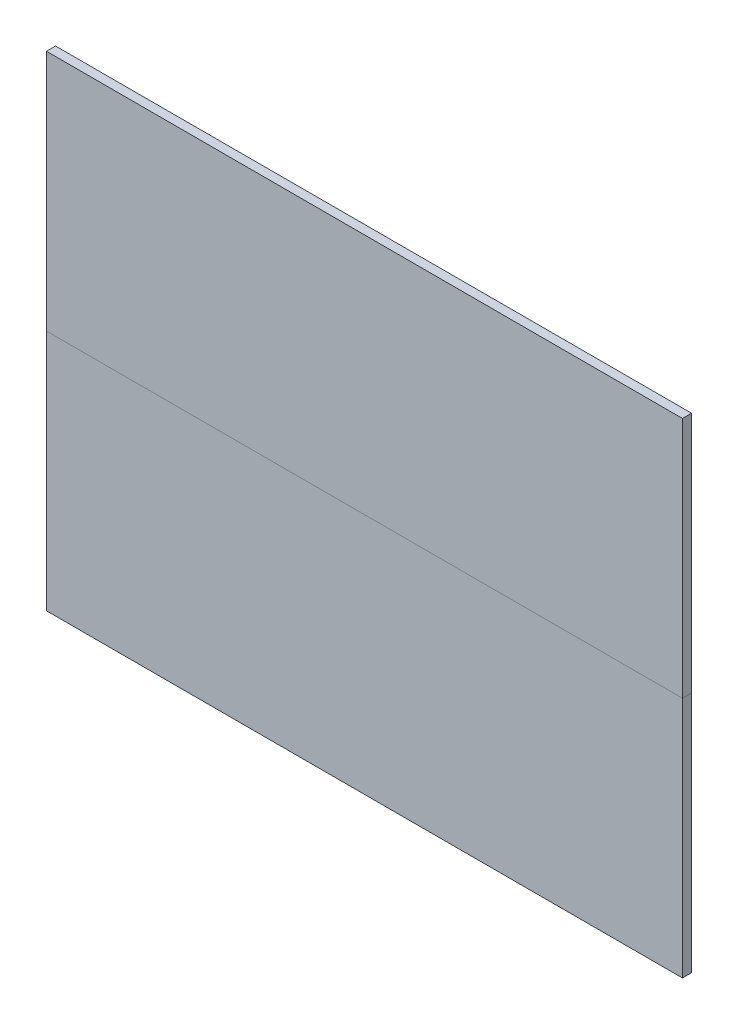
ISO-10303-21;
HEADER;
FILE_DESCRIPTION(('STEP AP214'),'2;1');
FILE_NAME('part.step','',(''),(''),'','','');
FILE_SCHEMA(('AUTOMOTIVE_DESIGN { 1 0 10303 214 1 1 1 1 }'));
ENDSEC;
DATA;
#1=APPLICATION_CONTEXT('core data for automotive mechanical design processes');
#2=APPLICATION_PROTOCOL_DEFINITION('international standard','automotive_design',2000,#1);
#3=PRODUCT_CONTEXT('',#1,'mechanical');
#4=PRODUCT('Part','Part','',(#3));
#5=PRODUCT_RELATED_PRODUCT_CATEGORY('part','',(#4));
#6=PRODUCT_DEFINITION_FORMATION('','',#4);
#7=PRODUCT_DEFINITION_CONTEXT('part definition',#1,'design');
#8=PRODUCT_DEFINITION('design','',#6,#7);
#9=PRODUCT_DEFINITION_SHAPE('','',#8);
#10=(LENGTH_UNIT() NAMED_UNIT(*) SI_UNIT(.MILLI.,.METRE.));
#11=(NAMED_UNIT(*) PLANE_ANGLE_UNIT() SI_UNIT($,.RADIAN.));
#12=(NAMED_UNIT(*) SI_UNIT($,.STERADIAN.) SOLID_ANGLE_UNIT());
#13=UNCERTAINTY_MEASURE_WITH_UNIT(LENGTH_MEASURE(1.E-05),#10,'distance_accuracy_value','');
#14=(GEOMETRIC_REPRESENTATION_CONTEXT(3) GLOBAL_UNCERTAINTY_ASSIGNED_CONTEXT((#13)) GLOBAL_UNIT_ASSIGNED_CONTEXT((#10,
#11,#12)) REPRESENTATION_CONTEXT('',''));
#15=CARTESIAN_POINT('',(0.,0.,0.));
#16=DIRECTION('',(0.,0.,1.));
#17=DIRECTION('',(1.,0.,0.));
#18=AXIS2_PLACEMENT_3D('',#15,#16,#17);
#19=CARTESIAN_POINT('',(0.,0.,0.));
#20=DIRECTION('',(0.,0.,-1.));
#21=DIRECTION('',(-1.,0.,0.));
#22=AXIS2_PLACEMENT_3D('',#19,#20,#21);
#23=PLANE('',#22);
#24=DIRECTION('',(0.,-1.,0.));
#25=VECTOR('',#24,1.);
#26=CARTESIAN_POINT('',(0.,8.,0.));
#27=LINE('',#26,#25);
#28=CARTESIAN_POINT('',(0.,16.,0.));
#29=VERTEX_POINT('',#28);
#30=CARTESIAN_POINT('',(0.,8.,0.));
#31=VERTEX_POINT('',#30);
#32=EDGE_CURVE('E54',#29,#31,#27,.T.);
#33=ORIENTED_EDGE('',*,*,#32,.F.);
#34=DIRECTION('',(-1.,0.,0.));
#35=VECTOR('',#34,1.);
#36=CARTESIAN_POINT('',(0.,16.,0.));
#37=LINE('',#36,#35);
#38=CARTESIAN_POINT('',(21.,16.,0.));
#39=VERTEX_POINT('',#38);
#40=EDGE_CURVE('E77',#39,#29,#37,.T.);
#41=ORIENTED_EDGE('',*,*,#40,.F.);
#42=DIRECTION('',(0.,1.,0.));
#43=VECTOR('',#42,1.);
#44=CARTESIAN_POINT('',(21.,8.,0.));
#45=LINE('',#44,#43);
#46=CARTESIAN_POINT('',(21.,8.,0.));
#47=VERTEX_POINT('',#46);
#48=EDGE_CURVE('E82',#47,#39,#45,.T.);
#49=ORIENTED_EDGE('',*,*,#48,.F.);
#50=DIRECTION('',(1.,0.,0.));
#51=VECTOR('',#50,1.);
#52=CARTESIAN_POINT('',(0.,8.,0.));
#53=LINE('',#52,#51);
#54=EDGE_CURVE('E97',#31,#47,#53,.T.);
#55=ORIENTED_EDGE('',*,*,#54,.F.);
#56=EDGE_LOOP('',(#33,#41,#49,#55));
#57=FACE_BOUND('',#56,.T.);
#58=ADVANCED_FACE('F46',(#57),#23,.T.);
#59=CARTESIAN_POINT('',(0.,0.,0.3));
#60=DIRECTION('',(0.,0.,-1.));
#61=DIRECTION('',(-1.,0.,0.));
#62=AXIS2_PLACEMENT_3D('',#59,#60,#61);
#63=PLANE('',#62);
#64=DIRECTION('',(0.,-1.,0.));
#65=VECTOR('',#64,1.);
#66=CARTESIAN_POINT('',(0.,8.,0.3));
#67=LINE('',#66,#65);
#68=CARTESIAN_POINT('',(0.,16.,0.3));
#69=VERTEX_POINT('',#68);
#70=CARTESIAN_POINT('',(0.,8.,0.3));
#71=VERTEX_POINT('',#70);
#72=EDGE_CURVE('E106',#69,#71,#67,.T.);
#73=ORIENTED_EDGE('',*,*,#72,.T.);
#74=DIRECTION('',(1.,0.,0.));
#75=VECTOR('',#74,1.);
#76=CARTESIAN_POINT('',(0.,8.,0.3));
#77=LINE('',#76,#75);
#78=CARTESIAN_POINT('',(21.,8.,0.3));
#79=VERTEX_POINT('',#78);
#80=EDGE_CURVE('E95',#71,#79,#77,.T.);
#81=ORIENTED_EDGE('',*,*,#80,.T.);
#82=DIRECTION('',(0.,1.,0.));
#83=VECTOR('',#82,1.);
#84=CARTESIAN_POINT('',(21.,8.,0.3));
#85=LINE('',#84,#83);
#86=CARTESIAN_POINT('',(21.,16.,0.3));
#87=VERTEX_POINT('',#86);
#88=EDGE_CURVE('E98',#79,#87,#85,.T.);
#89=ORIENTED_EDGE('',*,*,#88,.T.);
#90=DIRECTION('',(-1.,0.,0.));
#91=VECTOR('',#90,1.);
#92=CARTESIAN_POINT('',(0.,16.,0.3));
#93=LINE('',#92,#91);
#94=EDGE_CURVE('E103',#87,#69,#93,.T.);
#95=ORIENTED_EDGE('',*,*,#94,.T.);
#96=EDGE_LOOP('',(#73,#81,#89,#95));
#97=FACE_BOUND('',#96,.T.);
#98=ADVANCED_FACE('F105',(#97),#63,.F.);
#99=CARTESIAN_POINT('',(0.,8.,-22.4722050542442));
#100=DIRECTION('',(0.,-1.,0.));
#101=DIRECTION('',(0.,0.,-1.));
#102=AXIS2_PLACEMENT_3D('',#99,#100,#101);
#103=PLANE('',#102);
#104=DIRECTION('',(0.,0.,1.));
#105=VECTOR('',#104,1.);
#106=CARTESIAN_POINT('',(0.,8.,-22.4722050542442));
#107=LINE('',#106,#105);
#108=EDGE_CURVE('E12',#31,#71,#107,.T.);
#109=ORIENTED_EDGE('',*,*,#108,.F.);
#110=ORIENTED_EDGE('',*,*,#54,.T.);
#111=DIRECTION('',(0.,0.,1.));
#112=VECTOR('',#111,1.);
#113=CARTESIAN_POINT('',(21.,8.,-22.4722050542442));
#114=LINE('',#113,#112);
#115=EDGE_CURVE('E92',#47,#79,#114,.T.);
#116=ORIENTED_EDGE('',*,*,#115,.T.);
#117=ORIENTED_EDGE('',*,*,#80,.F.);
#118=EDGE_LOOP('',(#109,#110,#116,#117));
#119=FACE_BOUND('',#118,.T.);
#120=ADVANCED_FACE('F93',(#119),#103,.T.);
#121=CARTESIAN_POINT('',(21.,8.,-22.4722050542442));
#122=DIRECTION('',(1.,0.,0.));
#123=DIRECTION('',(0.,0.,-1.));
#124=AXIS2_PLACEMENT_3D('',#121,#122,#123);
#125=PLANE('',#124);
#126=ORIENTED_EDGE('',*,*,#115,.F.);
#127=ORIENTED_EDGE('',*,*,#48,.T.);
#128=DIRECTION('',(0.,0.,1.));
#129=VECTOR('',#128,1.);
#130=CARTESIAN_POINT('',(21.,16.,-22.4722050542442));
#131=LINE('',#130,#129);
#132=EDGE_CURVE('E87',#39,#87,#131,.T.);
#133=ORIENTED_EDGE('',*,*,#132,.T.);
#134=ORIENTED_EDGE('',*,*,#88,.F.);
#135=EDGE_LOOP('',(#126,#127,#133,#134));
#136=FACE_BOUND('',#135,.T.);
#137=ADVANCED_FACE('F99',(#136),#125,.T.);
#138=CARTESIAN_POINT('',(0.,16.,-22.4722050542442));
#139=DIRECTION('',(0.,1.,0.));
#140=DIRECTION('',(0.,0.,1.));
#141=AXIS2_PLACEMENT_3D('',#138,#139,#140);
#142=PLANE('',#141);
#143=ORIENTED_EDGE('',*,*,#132,.F.);
#144=ORIENTED_EDGE('',*,*,#40,.T.);
#145=DIRECTION('',(0.,0.,1.));
#146=VECTOR('',#145,1.);
#147=CARTESIAN_POINT('',(0.,16.,-22.4722050542442));
#148=LINE('',#147,#146);
#149=EDGE_CURVE('E113',#29,#69,#148,.T.);
#150=ORIENTED_EDGE('',*,*,#149,.T.);
#151=ORIENTED_EDGE('',*,*,#94,.F.);
#152=EDGE_LOOP('',(#143,#144,#150,#151));
#153=FACE_BOUND('',#152,.T.);
#154=ADVANCED_FACE('F119',(#153),#142,.T.);
#155=CARTESIAN_POINT('',(0.,8.,-22.4722050542442));
#156=DIRECTION('',(-1.,0.,0.));
#157=DIRECTION('',(0.,0.,1.));
#158=AXIS2_PLACEMENT_3D('',#155,#156,#157);
#159=PLANE('',#158);
#160=ORIENTED_EDGE('',*,*,#149,.F.);
#161=ORIENTED_EDGE('',*,*,#32,.T.);
#162=ORIENTED_EDGE('',*,*,#108,.T.);
#163=ORIENTED_EDGE('',*,*,#72,.F.);
#164=EDGE_LOOP('',(#160,#161,#162,#163));
#165=FACE_BOUND('',#164,.T.);
#166=ADVANCED_FACE('F120',(#165),#159,.T.);
#167=CLOSED_SHELL('',(#58,#98,#120,#137,#154,#166));
#168=MANIFOLD_SOLID_BREP('B2',#167);
#169=CARTESIAN_POINT('',(0.,0.,0.3));
#170=DIRECTION('',(1.,0.,0.));
#171=DIRECTION('',(0.,0.,-1.));
#172=AXIS2_PLACEMENT_3D('',#169,#170,#171);
#173=PLANE('',#172);
#174=DIRECTION('',(0.,-1.,0.));
#175=VECTOR('',#174,1.);
#176=CARTESIAN_POINT('',(0.,0.,0.));
#177=LINE('',#176,#175);
#178=CARTESIAN_POINT('',(0.,8.,0.));
#179=VERTEX_POINT('',#178);
#180=CARTESIAN_POINT('',(0.,0.,0.));
#181=VERTEX_POINT('',#180);
#182=EDGE_CURVE('E232',#179,#181,#177,.T.);
#183=ORIENTED_EDGE('',*,*,#182,.T.);
#184=DIRECTION('',(0.,0.,-1.));
#185=VECTOR('',#184,1.);
#186=CARTESIAN_POINT('',(0.,0.,0.3));
#187=LINE('',#186,#185);
#188=CARTESIAN_POINT('',(0.,0.,0.3));
#189=VERTEX_POINT('',#188);
#190=EDGE_CURVE('E44',#189,#181,#187,.T.);
#191=ORIENTED_EDGE('',*,*,#190,.F.);
#192=DIRECTION('',(0.,-1.,0.));
#193=VECTOR('',#192,1.);
#194=CARTESIAN_POINT('',(0.,0.,0.3));
#195=LINE('',#194,#193);
#196=CARTESIAN_POINT('',(0.,8.,0.3));
#197=VERTEX_POINT('',#196);
#198=EDGE_CURVE('E220',#197,#189,#195,.T.);
#199=ORIENTED_EDGE('',*,*,#198,.F.);
#200=DIRECTION('',(0.,0.,-1.));
#201=VECTOR('',#200,1.);
#202=CARTESIAN_POINT('',(0.,8.,0.3));
#203=LINE('',#202,#201);
#204=EDGE_CURVE('E228',#197,#179,#203,.T.);
#205=ORIENTED_EDGE('',*,*,#204,.T.);
#206=EDGE_LOOP('',(#183,#191,#199,#205));
#207=FACE_BOUND('',#206,.T.);
#208=ADVANCED_FACE('F169',(#207),#173,.F.);
#209=CARTESIAN_POINT('',(0.,0.,0.3));
#210=DIRECTION('',(0.,1.,0.));
#211=DIRECTION('',(0.,0.,1.));
#212=AXIS2_PLACEMENT_3D('',#209,#210,#211);
#213=PLANE('',#212);
#214=DIRECTION('',(1.,0.,0.));
#215=VECTOR('',#214,1.);
#216=CARTESIAN_POINT('',(0.,0.,0.));
#217=LINE('',#216,#215);
#218=CARTESIAN_POINT('',(21.,0.,0.));
#219=VERTEX_POINT('',#218);
#220=EDGE_CURVE('E224',#181,#219,#217,.T.);
#221=ORIENTED_EDGE('',*,*,#220,.T.);
#222=DIRECTION('',(0.,0.,-1.));
#223=VECTOR('',#222,1.);
#224=CARTESIAN_POINT('',(21.,0.,0.3));
#225=LINE('',#224,#223);
#226=CARTESIAN_POINT('',(21.,0.,0.3));
#227=VERTEX_POINT('',#226);
#228=EDGE_CURVE('E177',#227,#219,#225,.T.);
#229=ORIENTED_EDGE('',*,*,#228,.F.);
#230=DIRECTION('',(1.,0.,0.));
#231=VECTOR('',#230,1.);
#232=CARTESIAN_POINT('',(0.,0.,0.3));
#233=LINE('',#232,#231);
#234=EDGE_CURVE('E215',#189,#227,#233,.T.);
#235=ORIENTED_EDGE('',*,*,#234,.F.);
#236=ORIENTED_EDGE('',*,*,#190,.T.);
#237=EDGE_LOOP('',(#221,#229,#235,#236));
#238=FACE_BOUND('',#237,.T.);
#239=ADVANCED_FACE('F223',(#238),#213,.F.);
#240=CARTESIAN_POINT('',(21.,0.,0.3));
#241=DIRECTION('',(-1.,0.,0.));
#242=DIRECTION('',(0.,0.,1.));
#243=AXIS2_PLACEMENT_3D('',#240,#241,#242);
#244=PLANE('',#243);
#245=DIRECTION('',(0.,1.,0.));
#246=VECTOR('',#245,1.);
#247=CARTESIAN_POINT('',(21.,0.,0.));
#248=LINE('',#247,#246);
#249=CARTESIAN_POINT('',(21.,8.,0.));
#250=VERTEX_POINT('',#249);
#251=EDGE_CURVE('E202',#219,#250,#248,.T.);
#252=ORIENTED_EDGE('',*,*,#251,.T.);
#253=DIRECTION('',(0.,0.,-1.));
#254=VECTOR('',#253,1.);
#255=CARTESIAN_POINT('',(21.,8.,0.3));
#256=LINE('',#255,#254);
#257=CARTESIAN_POINT('',(21.,8.,0.3));
#258=VERTEX_POINT('',#257);
#259=EDGE_CURVE('E225',#258,#250,#256,.T.);
#260=ORIENTED_EDGE('',*,*,#259,.F.);
#261=DIRECTION('',(0.,1.,0.));
#262=VECTOR('',#261,1.);
#263=CARTESIAN_POINT('',(21.,0.,0.3));
#264=LINE('',#263,#262);
#265=EDGE_CURVE('E218',#227,#258,#264,.T.);
#266=ORIENTED_EDGE('',*,*,#265,.F.);
#267=ORIENTED_EDGE('',*,*,#228,.T.);
#268=EDGE_LOOP('',(#252,#260,#266,#267));
#269=FACE_BOUND('',#268,.T.);
#270=ADVANCED_FACE('F226',(#269),#244,.F.);
#271=CARTESIAN_POINT('',(0.,8.,0.3));
#272=DIRECTION('',(0.,-1.,0.));
#273=DIRECTION('',(0.,0.,-1.));
#274=AXIS2_PLACEMENT_3D('',#271,#272,#273);
#275=PLANE('',#274);
#276=DIRECTION('',(-1.,0.,0.));
#277=VECTOR('',#276,1.);
#278=CARTESIAN_POINT('',(0.,8.,0.));
#279=LINE('',#278,#277);
#280=EDGE_CURVE('E208',#250,#179,#279,.T.);
#281=ORIENTED_EDGE('',*,*,#280,.T.);
#282=ORIENTED_EDGE('',*,*,#204,.F.);
#283=DIRECTION('',(-1.,0.,0.));
#284=VECTOR('',#283,1.);
#285=CARTESIAN_POINT('',(0.,8.,0.3));
#286=LINE('',#285,#284);
#287=EDGE_CURVE('E185',#258,#197,#286,.T.);
#288=ORIENTED_EDGE('',*,*,#287,.F.);
#289=ORIENTED_EDGE('',*,*,#259,.T.);
#290=EDGE_LOOP('',(#281,#282,#288,#289));
#291=FACE_BOUND('',#290,.T.);
#292=ADVANCED_FACE('F239',(#291),#275,.F.);
#293=CARTESIAN_POINT('',(0.,0.,0.3));
#294=DIRECTION('',(0.,0.,-1.));
#295=DIRECTION('',(-1.,0.,0.));
#296=AXIS2_PLACEMENT_3D('',#293,#294,#295);
#297=PLANE('',#296);
#298=ORIENTED_EDGE('',*,*,#198,.T.);
#299=ORIENTED_EDGE('',*,*,#234,.T.);
#300=ORIENTED_EDGE('',*,*,#265,.T.);
#301=ORIENTED_EDGE('',*,*,#287,.T.);
#302=EDGE_LOOP('',(#298,#299,#300,#301));
#303=FACE_BOUND('',#302,.T.);
#304=ADVANCED_FACE('F216',(#303),#297,.F.);
#305=CARTESIAN_POINT('',(0.,0.,0.));
#306=DIRECTION('',(0.,0.,-1.));
#307=DIRECTION('',(-1.,0.,0.));
#308=AXIS2_PLACEMENT_3D('',#305,#306,#307);
#309=PLANE('',#308);
#310=ORIENTED_EDGE('',*,*,#182,.F.);
#311=ORIENTED_EDGE('',*,*,#280,.F.);
#312=ORIENTED_EDGE('',*,*,#251,.F.);
#313=ORIENTED_EDGE('',*,*,#220,.F.);
#314=EDGE_LOOP('',(#310,#311,#312,#313));
#315=FACE_BOUND('',#314,.T.);
#316=ADVANCED_FACE('F242',(#315),#309,.T.);
#317=CLOSED_SHELL('',(#208,#239,#270,#292,#304,#316));
#318=MANIFOLD_SOLID_BREP('B6',#317);
#319=ADVANCED_BREP_SHAPE_REPRESENTATION('',(#18,#168,#318),#14);
#320=SHAPE_DEFINITION_REPRESENTATION(#9,#319);
ENDSEC;
END-ISO-10303-21;
